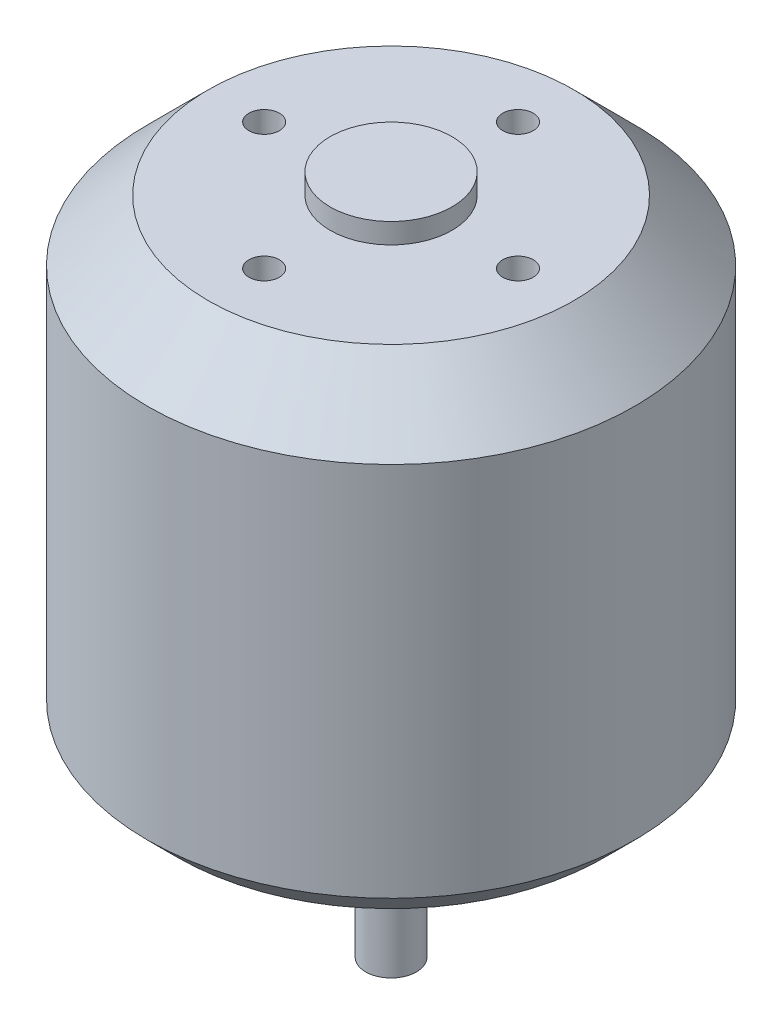
ISO-10303-21;
HEADER;
FILE_DESCRIPTION(('STEP AP214'),'2;1');
FILE_NAME('part.step','',(''),(''),'','','');
FILE_SCHEMA(('AUTOMOTIVE_DESIGN { 1 0 10303 214 1 1 1 1 }'));
ENDSEC;
DATA;
#1=APPLICATION_CONTEXT('core data for automotive mechanical design processes');
#2=APPLICATION_PROTOCOL_DEFINITION('international standard','automotive_design',2000,#1);
#3=PRODUCT_CONTEXT('',#1,'mechanical');
#4=PRODUCT('Part','Part','',(#3));
#5=PRODUCT_RELATED_PRODUCT_CATEGORY('part','',(#4));
#6=PRODUCT_DEFINITION_FORMATION('','',#4);
#7=PRODUCT_DEFINITION_CONTEXT('part definition',#1,'design');
#8=PRODUCT_DEFINITION('design','',#6,#7);
#9=PRODUCT_DEFINITION_SHAPE('','',#8);
#10=(LENGTH_UNIT() NAMED_UNIT(*) SI_UNIT(.MILLI.,.METRE.));
#11=(NAMED_UNIT(*) PLANE_ANGLE_UNIT() SI_UNIT($,.RADIAN.));
#12=(NAMED_UNIT(*) SI_UNIT($,.STERADIAN.) SOLID_ANGLE_UNIT());
#13=UNCERTAINTY_MEASURE_WITH_UNIT(LENGTH_MEASURE(1.E-05),#10,'distance_accuracy_value','');
#14=(GEOMETRIC_REPRESENTATION_CONTEXT(3) GLOBAL_UNCERTAINTY_ASSIGNED_CONTEXT((#13)) GLOBAL_UNIT_ASSIGNED_CONTEXT((#10,
#11,#12)) REPRESENTATION_CONTEXT('',''));
#15=CARTESIAN_POINT('',(0.,0.,0.));
#16=DIRECTION('',(0.,0.,1.));
#17=DIRECTION('',(1.,0.,0.));
#18=AXIS2_PLACEMENT_3D('',#15,#16,#17);
#19=CARTESIAN_POINT('',(0.,46.,0.));
#20=DIRECTION('',(0.,-1.,0.));
#21=DIRECTION('',(0.,0.,-1.));
#22=AXIS2_PLACEMENT_3D('',#19,#20,#21);
#23=CYLINDRICAL_SURFACE('',#22,24.);
#24=CARTESIAN_POINT('',(0.,3.00000000000001,0.));
#25=DIRECTION('',(0.,1.,0.));
#26=DIRECTION('',(0.,0.,1.));
#27=AXIS2_PLACEMENT_3D('',#24,#25,#26);
#28=CIRCLE('',#27,24.);
#29=CARTESIAN_POINT('',(0.,3.00000000000001,24.));
#30=VERTEX_POINT('',#29);
#31=EDGE_CURVE('E51',#30,#30,#28,.T.);
#32=ORIENTED_EDGE('',*,*,#31,.T.);
#33=EDGE_LOOP('',(#32));
#34=FACE_BOUND('',#33,.T.);
#35=CARTESIAN_POINT('',(0.,40.,0.));
#36=DIRECTION('',(0.,1.,0.));
#37=DIRECTION('',(0.,0.,1.));
#38=AXIS2_PLACEMENT_3D('',#35,#36,#37);
#39=CIRCLE('',#38,24.);
#40=CARTESIAN_POINT('',(0.,40.,24.));
#41=VERTEX_POINT('',#40);
#42=EDGE_CURVE('E55',#41,#41,#39,.F.);
#43=ORIENTED_EDGE('',*,*,#42,.T.);
#44=EDGE_LOOP('',(#43));
#45=FACE_BOUND('',#44,.T.);
#46=ADVANCED_FACE('F39',(#34,#45),#23,.T.);
#47=CARTESIAN_POINT('',(0.,46.,0.));
#48=DIRECTION('',(0.,1.,0.));
#49=DIRECTION('',(0.,0.,1.));
#50=AXIS2_PLACEMENT_3D('',#47,#48,#49);
#51=PLANE('',#50);
#52=CARTESIAN_POINT('',(-12.5,46.,0.));
#53=DIRECTION('',(0.,1.,0.));
#54=DIRECTION('',(0.,0.,1.));
#55=AXIS2_PLACEMENT_3D('',#52,#53,#54);
#56=CIRCLE('',#55,1.5);
#57=CARTESIAN_POINT('',(-12.5,46.,1.5));
#58=VERTEX_POINT('',#57);
#59=EDGE_CURVE('E89',#58,#58,#56,.F.);
#60=ORIENTED_EDGE('',*,*,#59,.T.);
#61=EDGE_LOOP('',(#60));
#62=FACE_BOUND('',#61,.T.);
#63=CARTESIAN_POINT('',(0.,46.,-12.5));
#64=DIRECTION('',(0.,1.,0.));
#65=DIRECTION('',(0.,0.,1.));
#66=AXIS2_PLACEMENT_3D('',#63,#64,#65);
#67=CIRCLE('',#66,1.5);
#68=CARTESIAN_POINT('',(0.,46.,-11.));
#69=VERTEX_POINT('',#68);
#70=EDGE_CURVE('E86',#69,#69,#67,.F.);
#71=ORIENTED_EDGE('',*,*,#70,.T.);
#72=EDGE_LOOP('',(#71));
#73=FACE_BOUND('',#72,.T.);
#74=CARTESIAN_POINT('',(12.5,46.,0.));
#75=DIRECTION('',(0.,-1.,0.));
#76=DIRECTION('',(0.,0.,-1.));
#77=AXIS2_PLACEMENT_3D('',#74,#75,#76);
#78=CIRCLE('',#77,1.5);
#79=CARTESIAN_POINT('',(12.5,46.,-1.5));
#80=VERTEX_POINT('',#79);
#81=EDGE_CURVE('E80',#80,#80,#78,.T.);
#82=ORIENTED_EDGE('',*,*,#81,.T.);
#83=EDGE_LOOP('',(#82));
#84=FACE_BOUND('',#83,.T.);
#85=CARTESIAN_POINT('',(0.,46.,12.5));
#86=DIRECTION('',(0.,-1.,0.));
#87=DIRECTION('',(0.,0.,-1.));
#88=AXIS2_PLACEMENT_3D('',#85,#86,#87);
#89=CIRCLE('',#88,1.5);
#90=CARTESIAN_POINT('',(0.,46.,11.));
#91=VERTEX_POINT('',#90);
#92=EDGE_CURVE('E73',#91,#91,#89,.T.);
#93=ORIENTED_EDGE('',*,*,#92,.T.);
#94=EDGE_LOOP('',(#93));
#95=FACE_BOUND('',#94,.T.);
#96=CARTESIAN_POINT('',(0.,46.,0.));
#97=DIRECTION('',(0.,1.,0.));
#98=DIRECTION('',(0.,0.,1.));
#99=AXIS2_PLACEMENT_3D('',#96,#97,#98);
#100=CIRCLE('',#99,18.);
#101=CARTESIAN_POINT('',(0.,46.,18.));
#102=VERTEX_POINT('',#101);
#103=EDGE_CURVE('E60',#102,#102,#100,.T.);
#104=ORIENTED_EDGE('',*,*,#103,.T.);
#105=EDGE_LOOP('',(#104));
#106=FACE_BOUND('',#105,.T.);
#107=CARTESIAN_POINT('',(0.,46.,0.));
#108=DIRECTION('',(0.,1.,0.));
#109=DIRECTION('',(0.,0.,1.));
#110=AXIS2_PLACEMENT_3D('',#107,#108,#109);
#111=CIRCLE('',#110,6.);
#112=CARTESIAN_POINT('',(0.,46.,6.));
#113=VERTEX_POINT('',#112);
#114=EDGE_CURVE('E63',#113,#113,#111,.T.);
#115=ORIENTED_EDGE('',*,*,#114,.F.);
#116=EDGE_LOOP('',(#115));
#117=FACE_BOUND('',#116,.T.);
#118=ADVANCED_FACE('F136',(#62,#73,#84,#95,#106,#117),#51,.T.);
#119=CARTESIAN_POINT('',(0.,0.,0.));
#120=DIRECTION('',(0.,1.,0.));
#121=DIRECTION('',(0.,0.,1.));
#122=AXIS2_PLACEMENT_3D('',#119,#120,#121);
#123=PLANE('',#122);
#124=CARTESIAN_POINT('',(0.,0.,0.));
#125=DIRECTION('',(0.,1.,0.));
#126=DIRECTION('',(0.,0.,1.));
#127=AXIS2_PLACEMENT_3D('',#124,#125,#126);
#128=CIRCLE('',#127,2.5);
#129=CARTESIAN_POINT('',(0.,0.,2.5));
#130=VERTEX_POINT('',#129);
#131=EDGE_CURVE('E10',#130,#130,#128,.F.);
#132=ORIENTED_EDGE('',*,*,#131,.F.);
#133=EDGE_LOOP('',(#132));
#134=FACE_BOUND('',#133,.T.);
#135=CARTESIAN_POINT('',(8.5,0.,0.));
#136=DIRECTION('',(0.,-1.,0.));
#137=DIRECTION('',(0.,0.,-1.));
#138=AXIS2_PLACEMENT_3D('',#135,#136,#137);
#139=CIRCLE('',#138,1.5);
#140=CARTESIAN_POINT('',(8.5,0.,-1.50000000000003));
#141=VERTEX_POINT('',#140);
#142=EDGE_CURVE('E113',#141,#141,#139,.T.);
#143=ORIENTED_EDGE('',*,*,#142,.F.);
#144=EDGE_LOOP('',(#143));
#145=FACE_BOUND('',#144,.T.);
#146=CARTESIAN_POINT('',(0.,0.,8.5));
#147=DIRECTION('',(0.,-1.,0.));
#148=DIRECTION('',(0.,0.,-1.));
#149=AXIS2_PLACEMENT_3D('',#146,#147,#148);
#150=CIRCLE('',#149,1.5);
#151=CARTESIAN_POINT('',(0.,0.,7.));
#152=VERTEX_POINT('',#151);
#153=EDGE_CURVE('E107',#152,#152,#150,.T.);
#154=ORIENTED_EDGE('',*,*,#153,.F.);
#155=EDGE_LOOP('',(#154));
#156=FACE_BOUND('',#155,.T.);
#157=CARTESIAN_POINT('',(-8.5,0.,0.));
#158=DIRECTION('',(0.,-1.,0.));
#159=DIRECTION('',(0.,0.,-1.));
#160=AXIS2_PLACEMENT_3D('',#157,#158,#159);
#161=CIRCLE('',#160,1.5);
#162=CARTESIAN_POINT('',(-8.5,0.,-1.49999999999991));
#163=VERTEX_POINT('',#162);
#164=EDGE_CURVE('E101',#163,#163,#161,.T.);
#165=ORIENTED_EDGE('',*,*,#164,.F.);
#166=EDGE_LOOP('',(#165));
#167=FACE_BOUND('',#166,.T.);
#168=CARTESIAN_POINT('',(0.,0.,-8.5));
#169=DIRECTION('',(0.,-1.,0.));
#170=DIRECTION('',(0.,0.,-1.));
#171=AXIS2_PLACEMENT_3D('',#168,#169,#170);
#172=CIRCLE('',#171,1.5);
#173=CARTESIAN_POINT('',(0.,0.,-10.));
#174=VERTEX_POINT('',#173);
#175=EDGE_CURVE('E94',#174,#174,#172,.T.);
#176=ORIENTED_EDGE('',*,*,#175,.F.);
#177=EDGE_LOOP('',(#176));
#178=FACE_BOUND('',#177,.T.);
#179=CARTESIAN_POINT('',(0.,0.,0.));
#180=DIRECTION('',(0.,1.,0.));
#181=DIRECTION('',(0.,0.,1.));
#182=AXIS2_PLACEMENT_3D('',#179,#180,#181);
#183=CIRCLE('',#182,21.);
#184=CARTESIAN_POINT('',(0.,0.,21.));
#185=VERTEX_POINT('',#184);
#186=EDGE_CURVE('E47',#185,#185,#183,.F.);
#187=ORIENTED_EDGE('',*,*,#186,.T.);
#188=EDGE_LOOP('',(#187));
#189=FACE_BOUND('',#188,.T.);
#190=ADVANCED_FACE('F142',(#134,#145,#156,#167,#178,#189),#123,.F.);
#191=CARTESIAN_POINT('',(0.,48.,0.));
#192=DIRECTION('',(0.,-1.,0.));
#193=DIRECTION('',(0.,0.,-1.));
#194=AXIS2_PLACEMENT_3D('',#191,#192,#193);
#195=CYLINDRICAL_SURFACE('',#194,6.);
#196=CARTESIAN_POINT('',(0.,48.,0.));
#197=DIRECTION('',(0.,1.,0.));
#198=DIRECTION('',(0.,0.,1.));
#199=AXIS2_PLACEMENT_3D('',#196,#197,#198);
#200=CIRCLE('',#199,6.);
#201=CARTESIAN_POINT('',(0.,48.,6.));
#202=VERTEX_POINT('',#201);
#203=EDGE_CURVE('E66',#202,#202,#200,.T.);
#204=ORIENTED_EDGE('',*,*,#203,.F.);
#205=EDGE_LOOP('',(#204));
#206=FACE_BOUND('',#205,.T.);
#207=ORIENTED_EDGE('',*,*,#114,.T.);
#208=EDGE_LOOP('',(#207));
#209=FACE_BOUND('',#208,.T.);
#210=ADVANCED_FACE('F160',(#206,#209),#195,.T.);
#211=CARTESIAN_POINT('',(0.,48.,0.));
#212=DIRECTION('',(0.,1.,0.));
#213=DIRECTION('',(0.,0.,1.));
#214=AXIS2_PLACEMENT_3D('',#211,#212,#213);
#215=PLANE('',#214);
#216=ORIENTED_EDGE('',*,*,#203,.T.);
#217=EDGE_LOOP('',(#216));
#218=FACE_BOUND('',#217,.T.);
#219=ADVANCED_FACE('F152',(#218),#215,.T.);
#220=CARTESIAN_POINT('',(0.,46.,0.));
#221=DIRECTION('',(0.,-1.,0.));
#222=DIRECTION('',(0.,0.,-1.));
#223=AXIS2_PLACEMENT_3D('',#220,#221,#222);
#224=CONICAL_SURFACE('',#223,18.,0.785398163397447);
#225=ORIENTED_EDGE('',*,*,#42,.F.);
#226=EDGE_LOOP('',(#225));
#227=FACE_BOUND('',#226,.T.);
#228=ORIENTED_EDGE('',*,*,#103,.F.);
#229=EDGE_LOOP('',(#228));
#230=FACE_BOUND('',#229,.T.);
#231=ADVANCED_FACE('F148',(#227,#230),#224,.T.);
#232=CARTESIAN_POINT('',(0.,3.00000000000001,0.));
#233=DIRECTION('',(0.,1.,0.));
#234=DIRECTION('',(0.,0.,1.));
#235=AXIS2_PLACEMENT_3D('',#232,#233,#234);
#236=CONICAL_SURFACE('',#235,24.,0.785398163397448);
#237=ORIENTED_EDGE('',*,*,#186,.F.);
#238=EDGE_LOOP('',(#237));
#239=FACE_BOUND('',#238,.T.);
#240=ORIENTED_EDGE('',*,*,#31,.F.);
#241=EDGE_LOOP('',(#240));
#242=FACE_BOUND('',#241,.T.);
#243=ADVANCED_FACE('F42',(#239,#242),#236,.T.);
#244=CARTESIAN_POINT('',(0.,38.,12.5));
#245=DIRECTION('',(0.,1.,0.));
#246=DIRECTION('',(0.,0.,1.));
#247=AXIS2_PLACEMENT_3D('',#244,#245,#246);
#248=CYLINDRICAL_SURFACE('',#247,1.5);
#249=CARTESIAN_POINT('',(0.,38.,12.5));
#250=DIRECTION('',(0.,-1.,0.));
#251=DIRECTION('',(0.,0.,-1.));
#252=AXIS2_PLACEMENT_3D('',#249,#250,#251);
#253=CIRCLE('',#252,1.5);
#254=CARTESIAN_POINT('',(0.,38.,11.));
#255=VERTEX_POINT('',#254);
#256=EDGE_CURVE('E70',#255,#255,#253,.T.);
#257=ORIENTED_EDGE('',*,*,#256,.T.);
#258=EDGE_LOOP('',(#257));
#259=FACE_BOUND('',#258,.T.);
#260=ORIENTED_EDGE('',*,*,#92,.F.);
#261=EDGE_LOOP('',(#260));
#262=FACE_BOUND('',#261,.T.);
#263=ADVANCED_FACE('F158',(#259,#262),#248,.F.);
#264=CARTESIAN_POINT('',(0.,38.,12.5));
#265=DIRECTION('',(0.,-1.,0.));
#266=DIRECTION('',(0.,0.,-1.));
#267=AXIS2_PLACEMENT_3D('',#264,#265,#266);
#268=PLANE('',#267);
#269=ORIENTED_EDGE('',*,*,#256,.F.);
#270=EDGE_LOOP('',(#269));
#271=FACE_BOUND('',#270,.T.);
#272=ADVANCED_FACE('F179',(#271),#268,.F.);
#273=CARTESIAN_POINT('',(12.5,38.,0.));
#274=DIRECTION('',(0.,1.,0.));
#275=DIRECTION('',(0.,0.,1.));
#276=AXIS2_PLACEMENT_3D('',#273,#274,#275);
#277=CYLINDRICAL_SURFACE('',#276,1.5);
#278=CARTESIAN_POINT('',(12.5,38.,0.));
#279=DIRECTION('',(0.,-1.,0.));
#280=DIRECTION('',(0.,0.,-1.));
#281=AXIS2_PLACEMENT_3D('',#278,#279,#280);
#282=CIRCLE('',#281,1.5);
#283=CARTESIAN_POINT('',(12.5,38.,-1.5));
#284=VERTEX_POINT('',#283);
#285=EDGE_CURVE('E77',#284,#284,#282,.T.);
#286=ORIENTED_EDGE('',*,*,#285,.T.);
#287=EDGE_LOOP('',(#286));
#288=FACE_BOUND('',#287,.T.);
#289=ORIENTED_EDGE('',*,*,#81,.F.);
#290=EDGE_LOOP('',(#289));
#291=FACE_BOUND('',#290,.T.);
#292=ADVANCED_FACE('F182',(#288,#291),#277,.F.);
#293=CARTESIAN_POINT('',(12.5,38.,0.));
#294=DIRECTION('',(0.,-1.,0.));
#295=DIRECTION('',(0.,0.,-1.));
#296=AXIS2_PLACEMENT_3D('',#293,#294,#295);
#297=PLANE('',#296);
#298=ORIENTED_EDGE('',*,*,#285,.F.);
#299=EDGE_LOOP('',(#298));
#300=FACE_BOUND('',#299,.T.);
#301=ADVANCED_FACE('F187',(#300),#297,.F.);
#302=CARTESIAN_POINT('',(0.,38.,-12.5));
#303=DIRECTION('',(0.,1.,0.));
#304=DIRECTION('',(0.,0.,1.));
#305=AXIS2_PLACEMENT_3D('',#302,#303,#304);
#306=CYLINDRICAL_SURFACE('',#305,1.5);
#307=CARTESIAN_POINT('',(0.,38.,-12.5));
#308=DIRECTION('',(0.,1.,0.));
#309=DIRECTION('',(0.,0.,1.));
#310=AXIS2_PLACEMENT_3D('',#307,#308,#309);
#311=CIRCLE('',#310,1.5);
#312=CARTESIAN_POINT('',(0.,38.,-11.));
#313=VERTEX_POINT('',#312);
#314=EDGE_CURVE('E83',#313,#313,#311,.F.);
#315=ORIENTED_EDGE('',*,*,#314,.T.);
#316=EDGE_LOOP('',(#315));
#317=FACE_BOUND('',#316,.T.);
#318=ORIENTED_EDGE('',*,*,#70,.F.);
#319=EDGE_LOOP('',(#318));
#320=FACE_BOUND('',#319,.T.);
#321=ADVANCED_FACE('F190',(#317,#320),#306,.F.);
#322=CARTESIAN_POINT('',(0.,38.,0.));
#323=DIRECTION('',(0.,1.,0.));
#324=DIRECTION('',(0.,0.,1.));
#325=AXIS2_PLACEMENT_3D('',#322,#323,#324);
#326=PLANE('',#325);
#327=ORIENTED_EDGE('',*,*,#314,.F.);
#328=EDGE_LOOP('',(#327));
#329=FACE_BOUND('',#328,.T.);
#330=ADVANCED_FACE('F195',(#329),#326,.T.);
#331=CARTESIAN_POINT('',(-12.5,38.,0.));
#332=DIRECTION('',(0.,1.,0.));
#333=DIRECTION('',(0.,0.,1.));
#334=AXIS2_PLACEMENT_3D('',#331,#332,#333);
#335=CYLINDRICAL_SURFACE('',#334,1.5);
#336=CARTESIAN_POINT('',(-12.5,38.,0.));
#337=DIRECTION('',(0.,1.,0.));
#338=DIRECTION('',(0.,0.,1.));
#339=AXIS2_PLACEMENT_3D('',#336,#337,#338);
#340=CIRCLE('',#339,1.5);
#341=CARTESIAN_POINT('',(-12.5,38.,1.5));
#342=VERTEX_POINT('',#341);
#343=EDGE_CURVE('E69',#342,#342,#340,.F.);
#344=ORIENTED_EDGE('',*,*,#343,.T.);
#345=EDGE_LOOP('',(#344));
#346=FACE_BOUND('',#345,.T.);
#347=ORIENTED_EDGE('',*,*,#59,.F.);
#348=EDGE_LOOP('',(#347));
#349=FACE_BOUND('',#348,.T.);
#350=ADVANCED_FACE('F198',(#346,#349),#335,.F.);
#351=CARTESIAN_POINT('',(0.,38.,0.));
#352=DIRECTION('',(0.,1.,0.));
#353=DIRECTION('',(0.,0.,1.));
#354=AXIS2_PLACEMENT_3D('',#351,#352,#353);
#355=PLANE('',#354);
#356=ORIENTED_EDGE('',*,*,#343,.F.);
#357=EDGE_LOOP('',(#356));
#358=FACE_BOUND('',#357,.T.);
#359=ADVANCED_FACE('F205',(#358),#355,.T.);
#360=CARTESIAN_POINT('',(0.,8.,-8.5));
#361=DIRECTION('',(0.,-1.,0.));
#362=DIRECTION('',(0.,0.,-1.));
#363=AXIS2_PLACEMENT_3D('',#360,#361,#362);
#364=CYLINDRICAL_SURFACE('',#363,1.5);
#365=CARTESIAN_POINT('',(0.,8.,-8.5));
#366=DIRECTION('',(0.,-1.,0.));
#367=DIRECTION('',(0.,0.,-1.));
#368=AXIS2_PLACEMENT_3D('',#365,#366,#367);
#369=CIRCLE('',#368,1.5);
#370=CARTESIAN_POINT('',(0.,8.,-10.));
#371=VERTEX_POINT('',#370);
#372=EDGE_CURVE('E97',#371,#371,#369,.T.);
#373=ORIENTED_EDGE('',*,*,#372,.F.);
#374=EDGE_LOOP('',(#373));
#375=FACE_BOUND('',#374,.T.);
#376=ORIENTED_EDGE('',*,*,#175,.T.);
#377=EDGE_LOOP('',(#376));
#378=FACE_BOUND('',#377,.T.);
#379=ADVANCED_FACE('F209',(#375,#378),#364,.F.);
#380=CARTESIAN_POINT('',(0.,8.,0.));
#381=DIRECTION('',(0.,-1.,0.));
#382=DIRECTION('',(0.,0.,-1.));
#383=AXIS2_PLACEMENT_3D('',#380,#381,#382);
#384=PLANE('',#383);
#385=ORIENTED_EDGE('',*,*,#372,.T.);
#386=EDGE_LOOP('',(#385));
#387=FACE_BOUND('',#386,.T.);
#388=ADVANCED_FACE('F213',(#387),#384,.T.);
#389=CARTESIAN_POINT('',(-8.5,8.,0.));
#390=DIRECTION('',(0.,-1.,0.));
#391=DIRECTION('',(0.,0.,-1.));
#392=AXIS2_PLACEMENT_3D('',#389,#390,#391);
#393=CYLINDRICAL_SURFACE('',#392,1.5);
#394=CARTESIAN_POINT('',(-8.5,8.,0.));
#395=DIRECTION('',(0.,-1.,0.));
#396=DIRECTION('',(0.,0.,-1.));
#397=AXIS2_PLACEMENT_3D('',#394,#395,#396);
#398=CIRCLE('',#397,1.5);
#399=CARTESIAN_POINT('',(-8.5,8.,-1.49999999999991));
#400=VERTEX_POINT('',#399);
#401=EDGE_CURVE('E104',#400,#400,#398,.T.);
#402=ORIENTED_EDGE('',*,*,#401,.F.);
#403=EDGE_LOOP('',(#402));
#404=FACE_BOUND('',#403,.T.);
#405=ORIENTED_EDGE('',*,*,#164,.T.);
#406=EDGE_LOOP('',(#405));
#407=FACE_BOUND('',#406,.T.);
#408=ADVANCED_FACE('F217',(#404,#407),#393,.F.);
#409=CARTESIAN_POINT('',(0.,8.,0.));
#410=DIRECTION('',(0.,-1.,0.));
#411=DIRECTION('',(0.,0.,-1.));
#412=AXIS2_PLACEMENT_3D('',#409,#410,#411);
#413=PLANE('',#412);
#414=ORIENTED_EDGE('',*,*,#401,.T.);
#415=EDGE_LOOP('',(#414));
#416=FACE_BOUND('',#415,.T.);
#417=ADVANCED_FACE('F221',(#416),#413,.T.);
#418=CARTESIAN_POINT('',(0.,8.,8.5));
#419=DIRECTION('',(0.,-1.,0.));
#420=DIRECTION('',(0.,0.,-1.));
#421=AXIS2_PLACEMENT_3D('',#418,#419,#420);
#422=CYLINDRICAL_SURFACE('',#421,1.5);
#423=CARTESIAN_POINT('',(0.,8.,8.5));
#424=DIRECTION('',(0.,-1.,0.));
#425=DIRECTION('',(0.,0.,-1.));
#426=AXIS2_PLACEMENT_3D('',#423,#424,#425);
#427=CIRCLE('',#426,1.5);
#428=CARTESIAN_POINT('',(0.,8.,7.));
#429=VERTEX_POINT('',#428);
#430=EDGE_CURVE('E110',#429,#429,#427,.T.);
#431=ORIENTED_EDGE('',*,*,#430,.F.);
#432=EDGE_LOOP('',(#431));
#433=FACE_BOUND('',#432,.T.);
#434=ORIENTED_EDGE('',*,*,#153,.T.);
#435=EDGE_LOOP('',(#434));
#436=FACE_BOUND('',#435,.T.);
#437=ADVANCED_FACE('F225',(#433,#436),#422,.F.);
#438=CARTESIAN_POINT('',(0.,8.,0.));
#439=DIRECTION('',(0.,-1.,0.));
#440=DIRECTION('',(0.,0.,-1.));
#441=AXIS2_PLACEMENT_3D('',#438,#439,#440);
#442=PLANE('',#441);
#443=ORIENTED_EDGE('',*,*,#430,.T.);
#444=EDGE_LOOP('',(#443));
#445=FACE_BOUND('',#444,.T.);
#446=ADVANCED_FACE('F229',(#445),#442,.T.);
#447=CARTESIAN_POINT('',(8.5,8.,0.));
#448=DIRECTION('',(0.,-1.,0.));
#449=DIRECTION('',(0.,0.,-1.));
#450=AXIS2_PLACEMENT_3D('',#447,#448,#449);
#451=CYLINDRICAL_SURFACE('',#450,1.5);
#452=CARTESIAN_POINT('',(8.5,8.,0.));
#453=DIRECTION('',(0.,-1.,0.));
#454=DIRECTION('',(0.,0.,-1.));
#455=AXIS2_PLACEMENT_3D('',#452,#453,#454);
#456=CIRCLE('',#455,1.5);
#457=CARTESIAN_POINT('',(8.5,8.,-1.50000000000003));
#458=VERTEX_POINT('',#457);
#459=EDGE_CURVE('E74',#458,#458,#456,.T.);
#460=ORIENTED_EDGE('',*,*,#459,.F.);
#461=EDGE_LOOP('',(#460));
#462=FACE_BOUND('',#461,.T.);
#463=ORIENTED_EDGE('',*,*,#142,.T.);
#464=EDGE_LOOP('',(#463));
#465=FACE_BOUND('',#464,.T.);
#466=ADVANCED_FACE('F132',(#462,#465),#451,.F.);
#467=CARTESIAN_POINT('',(0.,8.,0.));
#468=DIRECTION('',(0.,-1.,0.));
#469=DIRECTION('',(0.,0.,-1.));
#470=AXIS2_PLACEMENT_3D('',#467,#468,#469);
#471=PLANE('',#470);
#472=ORIENTED_EDGE('',*,*,#459,.T.);
#473=EDGE_LOOP('',(#472));
#474=FACE_BOUND('',#473,.T.);
#475=ADVANCED_FACE('F125',(#474),#471,.T.);
#476=CARTESIAN_POINT('',(0.,-19.,0.));
#477=DIRECTION('',(0.,1.,0.));
#478=DIRECTION('',(0.,0.,1.));
#479=AXIS2_PLACEMENT_3D('',#476,#477,#478);
#480=CYLINDRICAL_SURFACE('',#479,2.5);
#481=CARTESIAN_POINT('',(0.,-19.,0.));
#482=DIRECTION('',(0.,-1.,0.));
#483=DIRECTION('',(0.,0.,-1.));
#484=AXIS2_PLACEMENT_3D('',#481,#482,#483);
#485=CIRCLE('',#484,2.5);
#486=CARTESIAN_POINT('',(0.,-19.,-2.5));
#487=VERTEX_POINT('',#486);
#488=EDGE_CURVE('E98',#487,#487,#485,.T.);
#489=ORIENTED_EDGE('',*,*,#488,.F.);
#490=EDGE_LOOP('',(#489));
#491=FACE_BOUND('',#490,.T.);
#492=ORIENTED_EDGE('',*,*,#131,.T.);
#493=EDGE_LOOP('',(#492));
#494=FACE_BOUND('',#493,.T.);
#495=ADVANCED_FACE('F123',(#491,#494),#480,.T.);
#496=CARTESIAN_POINT('',(0.,-19.,0.));
#497=DIRECTION('',(0.,-1.,0.));
#498=DIRECTION('',(0.,0.,-1.));
#499=AXIS2_PLACEMENT_3D('',#496,#497,#498);
#500=PLANE('',#499);
#501=ORIENTED_EDGE('',*,*,#488,.T.);
#502=EDGE_LOOP('',(#501));
#503=FACE_BOUND('',#502,.T.);
#504=ADVANCED_FACE('F121',(#503),#500,.T.);
#505=CLOSED_SHELL('',(#46,#118,#190,#210,#219,#231,#243,#263,#272,#292,#301,#321,#330,#350,#359,
#379,#388,#408,#417,#437,#446,#466,#475,#495,#504));
#506=MANIFOLD_SOLID_BREP('B2',#505);
#507=ADVANCED_BREP_SHAPE_REPRESENTATION('',(#18,#506),#14);
#508=SHAPE_DEFINITION_REPRESENTATION(#9,#507);
ENDSEC;
END-ISO-10303-21;
